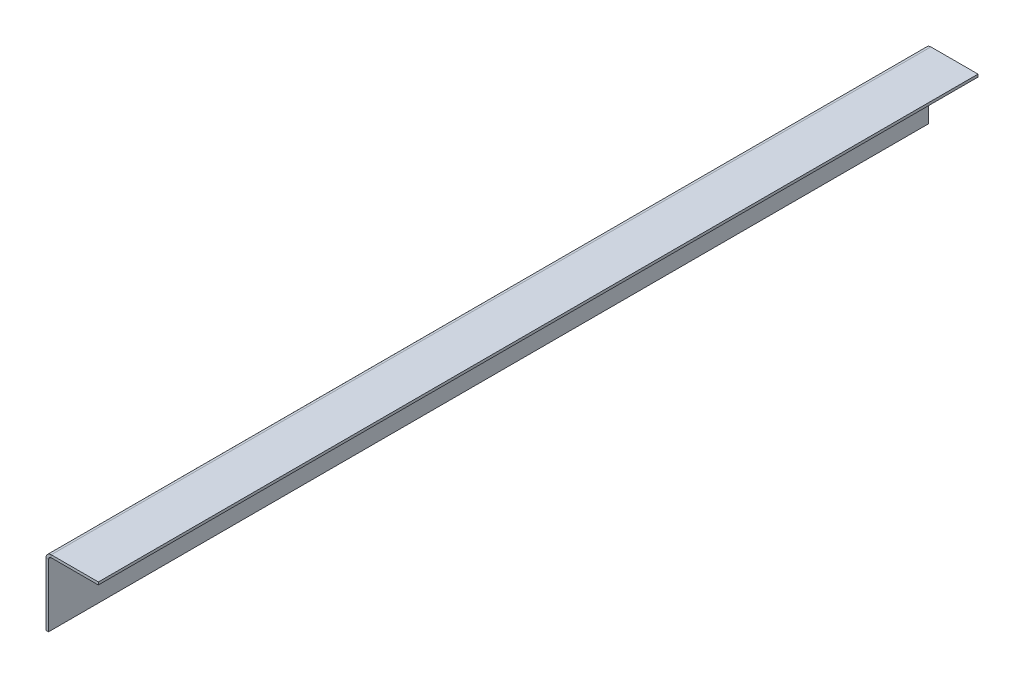
ISO-10303-21;
HEADER;
FILE_DESCRIPTION(('STEP AP214'),'2;1');
FILE_NAME('part.step','',(''),(''),'','','');
FILE_SCHEMA(('AUTOMOTIVE_DESIGN { 1 0 10303 214 1 1 1 1 }'));
ENDSEC;
DATA;
#1=APPLICATION_CONTEXT('core data for automotive mechanical design processes');
#2=APPLICATION_PROTOCOL_DEFINITION('international standard','automotive_design',2000,#1);
#3=PRODUCT_CONTEXT('',#1,'mechanical');
#4=PRODUCT('Part','Part','',(#3));
#5=PRODUCT_RELATED_PRODUCT_CATEGORY('part','',(#4));
#6=PRODUCT_DEFINITION_FORMATION('','',#4);
#7=PRODUCT_DEFINITION_CONTEXT('part definition',#1,'design');
#8=PRODUCT_DEFINITION('design','',#6,#7);
#9=PRODUCT_DEFINITION_SHAPE('','',#8);
#10=(LENGTH_UNIT() NAMED_UNIT(*) SI_UNIT(.MILLI.,.METRE.));
#11=(NAMED_UNIT(*) PLANE_ANGLE_UNIT() SI_UNIT($,.RADIAN.));
#12=(NAMED_UNIT(*) SI_UNIT($,.STERADIAN.) SOLID_ANGLE_UNIT());
#13=UNCERTAINTY_MEASURE_WITH_UNIT(LENGTH_MEASURE(1.E-05),#10,'distance_accuracy_value','');
#14=(GEOMETRIC_REPRESENTATION_CONTEXT(3) GLOBAL_UNCERTAINTY_ASSIGNED_CONTEXT((#13)) GLOBAL_UNIT_ASSIGNED_CONTEXT((#10,
#11,#12)) REPRESENTATION_CONTEXT('',''));
#15=CARTESIAN_POINT('',(0.,0.,0.));
#16=DIRECTION('',(0.,0.,1.));
#17=DIRECTION('',(1.,0.,0.));
#18=AXIS2_PLACEMENT_3D('',#15,#16,#17);
#19=CARTESIAN_POINT('',(-3.175,0.,0.));
#20=DIRECTION('',(0.,0.,1.));
#21=DIRECTION('',(1.,0.,0.));
#22=AXIS2_PLACEMENT_3D('',#19,#20,#21);
#23=PLANE('',#22);
#24=DIRECTION('',(0.,-1.,0.));
#25=VECTOR('',#24,1.);
#26=CARTESIAN_POINT('',(0.,0.,0.));
#27=LINE('',#26,#25);
#28=CARTESIAN_POINT('',(0.,76.2,0.));
#29=VERTEX_POINT('',#28);
#30=CARTESIAN_POINT('',(0.,0.,0.));
#31=VERTEX_POINT('',#30);
#32=EDGE_CURVE('E99',#29,#31,#27,.T.);
#33=ORIENTED_EDGE('',*,*,#32,.F.);
#34=DIRECTION('',(-1.,0.,0.));
#35=VECTOR('',#34,1.);
#36=CARTESIAN_POINT('',(0.,76.2,0.));
#37=LINE('',#36,#35);
#38=CARTESIAN_POINT('',(-3.17500000000001,76.2,0.));
#39=VERTEX_POINT('',#38);
#40=EDGE_CURVE('E117',#29,#39,#37,.T.);
#41=ORIENTED_EDGE('',*,*,#40,.T.);
#42=DIRECTION('',(0.,-1.,0.));
#43=VECTOR('',#42,1.);
#44=CARTESIAN_POINT('',(-3.175,0.,0.));
#45=LINE('',#44,#43);
#46=CARTESIAN_POINT('',(-3.175,0.,0.));
#47=VERTEX_POINT('',#46);
#48=EDGE_CURVE('E84',#39,#47,#45,.T.);
#49=ORIENTED_EDGE('',*,*,#48,.T.);
#50=DIRECTION('',(1.,0.,0.));
#51=VECTOR('',#50,1.);
#52=CARTESIAN_POINT('',(-3.175,0.,0.));
#53=LINE('',#52,#51);
#54=EDGE_CURVE('E13',#47,#31,#53,.T.);
#55=ORIENTED_EDGE('',*,*,#54,.T.);
#56=EDGE_LOOP('',(#33,#41,#49,#55));
#57=FACE_BOUND('',#56,.T.);
#58=ADVANCED_FACE('F61',(#57),#23,.T.);
#59=CARTESIAN_POINT('',(-3.175,0.,0.));
#60=DIRECTION('',(-1.,0.,0.));
#61=DIRECTION('',(0.,0.,1.));
#62=AXIS2_PLACEMENT_3D('',#59,#60,#61);
#63=PLANE('',#62);
#64=ORIENTED_EDGE('',*,*,#48,.F.);
#65=DIRECTION('',(0.,0.,1.));
#66=VECTOR('',#65,1.);
#67=CARTESIAN_POINT('',(-3.17500000000001,76.2,0.));
#68=LINE('',#67,#66);
#69=CARTESIAN_POINT('',(-3.175,76.2,-1066.8));
#70=VERTEX_POINT('',#69);
#71=EDGE_CURVE('E137',#39,#70,#68,.F.);
#72=ORIENTED_EDGE('',*,*,#71,.T.);
#73=DIRECTION('',(0.,1.,0.));
#74=VECTOR('',#73,1.);
#75=CARTESIAN_POINT('',(-3.175,0.,-1066.8));
#76=LINE('',#75,#74);
#77=CARTESIAN_POINT('',(-3.175,0.,-1066.8));
#78=VERTEX_POINT('',#77);
#79=EDGE_CURVE('E121',#78,#70,#76,.T.);
#80=ORIENTED_EDGE('',*,*,#79,.F.);
#81=DIRECTION('',(0.,0.,-1.));
#82=VECTOR('',#81,1.);
#83=CARTESIAN_POINT('',(-3.175,0.,-1066.8));
#84=LINE('',#83,#82);
#85=EDGE_CURVE('E107',#47,#78,#84,.T.);
#86=ORIENTED_EDGE('',*,*,#85,.F.);
#87=EDGE_LOOP('',(#64,#72,#80,#86));
#88=FACE_BOUND('',#87,.T.);
#89=ADVANCED_FACE('F230',(#88),#63,.T.);
#90=CARTESIAN_POINT('',(0.,0.,0.));
#91=DIRECTION('',(-1.,0.,0.));
#92=DIRECTION('',(0.,0.,1.));
#93=AXIS2_PLACEMENT_3D('',#90,#91,#92);
#94=PLANE('',#93);
#95=DIRECTION('',(0.,0.,1.));
#96=VECTOR('',#95,1.);
#97=CARTESIAN_POINT('',(0.,76.2,0.));
#98=LINE('',#97,#96);
#99=CARTESIAN_POINT('',(0.,76.2,-1066.8));
#100=VERTEX_POINT('',#99);
#101=EDGE_CURVE('E106',#29,#100,#98,.F.);
#102=ORIENTED_EDGE('',*,*,#101,.F.);
#103=ORIENTED_EDGE('',*,*,#32,.T.);
#104=DIRECTION('',(0.,0.,-1.));
#105=VECTOR('',#104,1.);
#106=CARTESIAN_POINT('',(0.,0.,-1066.8));
#107=LINE('',#106,#105);
#108=CARTESIAN_POINT('',(0.,0.,-1066.8));
#109=VERTEX_POINT('',#108);
#110=EDGE_CURVE('E103',#31,#109,#107,.T.);
#111=ORIENTED_EDGE('',*,*,#110,.T.);
#112=DIRECTION('',(0.,1.,0.));
#113=VECTOR('',#112,1.);
#114=CARTESIAN_POINT('',(0.,0.,-1066.8));
#115=LINE('',#114,#113);
#116=EDGE_CURVE('E108',#109,#100,#115,.T.);
#117=ORIENTED_EDGE('',*,*,#116,.T.);
#118=EDGE_LOOP('',(#102,#103,#111,#117));
#119=FACE_BOUND('',#118,.T.);
#120=ADVANCED_FACE('F100',(#119),#94,.F.);
#121=CARTESIAN_POINT('',(-3.175,0.,-1066.8));
#122=DIRECTION('',(0.,-1.,0.));
#123=DIRECTION('',(0.,0.,-1.));
#124=AXIS2_PLACEMENT_3D('',#121,#122,#123);
#125=PLANE('',#124);
#126=ORIENTED_EDGE('',*,*,#110,.F.);
#127=ORIENTED_EDGE('',*,*,#54,.F.);
#128=ORIENTED_EDGE('',*,*,#85,.T.);
#129=DIRECTION('',(1.,0.,0.));
#130=VECTOR('',#129,1.);
#131=CARTESIAN_POINT('',(-3.175,0.,-1066.8));
#132=LINE('',#131,#130);
#133=EDGE_CURVE('E65',#78,#109,#132,.T.);
#134=ORIENTED_EDGE('',*,*,#133,.T.);
#135=EDGE_LOOP('',(#126,#127,#128,#134));
#136=FACE_BOUND('',#135,.T.);
#137=ADVANCED_FACE('F63',(#136),#125,.T.);
#138=CARTESIAN_POINT('',(-3.175,0.,-1066.8));
#139=DIRECTION('',(0.,0.,-1.));
#140=DIRECTION('',(0.,1.,0.));
#141=AXIS2_PLACEMENT_3D('',#138,#139,#140);
#142=PLANE('',#141);
#143=DIRECTION('',(-1.,0.,0.));
#144=VECTOR('',#143,1.);
#145=CARTESIAN_POINT('',(0.,76.2,-1066.8));
#146=LINE('',#145,#144);
#147=EDGE_CURVE('E114',#100,#70,#146,.T.);
#148=ORIENTED_EDGE('',*,*,#147,.F.);
#149=ORIENTED_EDGE('',*,*,#116,.F.);
#150=ORIENTED_EDGE('',*,*,#133,.F.);
#151=ORIENTED_EDGE('',*,*,#79,.T.);
#152=EDGE_LOOP('',(#148,#149,#150,#151));
#153=FACE_BOUND('',#152,.T.);
#154=ADVANCED_FACE('F227',(#153),#142,.T.);
#155=CARTESIAN_POINT('',(3.17499999999999,76.2,-1066.8));
#156=DIRECTION('',(0.,0.,-1.));
#157=DIRECTION('',(-1.,0.,0.));
#158=AXIS2_PLACEMENT_3D('',#155,#156,#157);
#159=PLANE('',#158);
#160=DIRECTION('',(0.,-1.,0.));
#161=VECTOR('',#160,1.);
#162=CARTESIAN_POINT('',(3.17499999999997,82.55,-1066.8));
#163=LINE('',#162,#161);
#164=CARTESIAN_POINT('',(3.17499999999998,79.375,-1066.8));
#165=VERTEX_POINT('',#164);
#166=CARTESIAN_POINT('',(3.17499999999997,82.55,-1066.8));
#167=VERTEX_POINT('',#166);
#168=EDGE_CURVE('E141',#165,#167,#163,.F.);
#169=ORIENTED_EDGE('',*,*,#168,.F.);
#170=CARTESIAN_POINT('',(3.17499999999999,76.2,-1066.8));
#171=DIRECTION('',(0.,0.,1.));
#172=DIRECTION('',(1.,0.,0.));
#173=AXIS2_PLACEMENT_3D('',#170,#171,#172);
#174=CIRCLE('',#173,3.175);
#175=EDGE_CURVE('E131',#100,#165,#174,.F.);
#176=ORIENTED_EDGE('',*,*,#175,.F.);
#177=ORIENTED_EDGE('',*,*,#147,.T.);
#178=CARTESIAN_POINT('',(3.17499999999999,76.2,-1066.8));
#179=DIRECTION('',(0.,0.,1.));
#180=DIRECTION('',(1.,0.,0.));
#181=AXIS2_PLACEMENT_3D('',#178,#179,#180);
#182=CIRCLE('',#181,6.35);
#183=EDGE_CURVE('E76',#70,#167,#182,.F.);
#184=ORIENTED_EDGE('',*,*,#183,.T.);
#185=EDGE_LOOP('',(#169,#176,#177,#184));
#186=FACE_BOUND('',#185,.T.);
#187=ADVANCED_FACE('F224',(#186),#159,.T.);
#188=CARTESIAN_POINT('',(3.17499999999999,76.2,0.));
#189=DIRECTION('',(0.,0.,-1.));
#190=DIRECTION('',(-1.,0.,0.));
#191=AXIS2_PLACEMENT_3D('',#188,#189,#190);
#192=PLANE('',#191);
#193=CARTESIAN_POINT('',(3.17499999999999,76.2,0.));
#194=DIRECTION('',(0.,0.,1.));
#195=DIRECTION('',(1.,0.,0.));
#196=AXIS2_PLACEMENT_3D('',#193,#194,#195);
#197=CIRCLE('',#196,3.175);
#198=CARTESIAN_POINT('',(3.17499999999998,79.375,0.));
#199=VERTEX_POINT('',#198);
#200=EDGE_CURVE('E126',#199,#29,#197,.T.);
#201=ORIENTED_EDGE('',*,*,#200,.F.);
#202=DIRECTION('',(0.,-1.,0.));
#203=VECTOR('',#202,1.);
#204=CARTESIAN_POINT('',(3.17499999999997,79.375,0.));
#205=LINE('',#204,#203);
#206=CARTESIAN_POINT('',(3.17499999999996,82.55,0.));
#207=VERTEX_POINT('',#206);
#208=EDGE_CURVE('E147',#199,#207,#205,.F.);
#209=ORIENTED_EDGE('',*,*,#208,.T.);
#210=CARTESIAN_POINT('',(3.17499999999999,76.2,0.));
#211=DIRECTION('',(0.,0.,1.));
#212=DIRECTION('',(1.,0.,0.));
#213=AXIS2_PLACEMENT_3D('',#210,#211,#212);
#214=CIRCLE('',#213,6.35);
#215=EDGE_CURVE('E134',#207,#39,#214,.T.);
#216=ORIENTED_EDGE('',*,*,#215,.T.);
#217=ORIENTED_EDGE('',*,*,#40,.F.);
#218=EDGE_LOOP('',(#201,#209,#216,#217));
#219=FACE_BOUND('',#218,.T.);
#220=ADVANCED_FACE('F221',(#219),#192,.F.);
#221=CARTESIAN_POINT('',(3.17499999999999,76.2,0.));
#222=DIRECTION('',(0.,0.,1.));
#223=DIRECTION('',(0.,1.,0.));
#224=AXIS2_PLACEMENT_3D('',#221,#222,#223);
#225=CYLINDRICAL_SURFACE('',#224,6.35);
#226=ORIENTED_EDGE('',*,*,#71,.F.);
#227=ORIENTED_EDGE('',*,*,#215,.F.);
#228=DIRECTION('',(0.,0.,1.));
#229=VECTOR('',#228,1.);
#230=CARTESIAN_POINT('',(3.17499999999997,82.55,-1066.8));
#231=LINE('',#230,#229);
#232=EDGE_CURVE('E150',#207,#167,#231,.F.);
#233=ORIENTED_EDGE('',*,*,#232,.T.);
#234=ORIENTED_EDGE('',*,*,#183,.F.);
#235=EDGE_LOOP('',(#226,#227,#233,#234));
#236=FACE_BOUND('',#235,.T.);
#237=ADVANCED_FACE('F231',(#236),#225,.T.);
#238=CARTESIAN_POINT('',(3.17499999999999,76.2,0.));
#239=DIRECTION('',(0.,0.,1.));
#240=DIRECTION('',(0.,1.,0.));
#241=AXIS2_PLACEMENT_3D('',#238,#239,#240);
#242=CYLINDRICAL_SURFACE('',#241,3.175);
#243=ORIENTED_EDGE('',*,*,#101,.T.);
#244=ORIENTED_EDGE('',*,*,#175,.T.);
#245=DIRECTION('',(0.,0.,1.));
#246=VECTOR('',#245,1.);
#247=CARTESIAN_POINT('',(3.17499999999998,79.375,-1066.8));
#248=LINE('',#247,#246);
#249=EDGE_CURVE('E144',#165,#199,#248,.T.);
#250=ORIENTED_EDGE('',*,*,#249,.T.);
#251=ORIENTED_EDGE('',*,*,#200,.T.);
#252=EDGE_LOOP('',(#243,#244,#250,#251));
#253=FACE_BOUND('',#252,.T.);
#254=ADVANCED_FACE('F223',(#253),#242,.F.);
#255=CARTESIAN_POINT('',(0.,82.55,-1066.8));
#256=DIRECTION('',(0.,0.,1.));
#257=DIRECTION('',(1.,0.,0.));
#258=AXIS2_PLACEMENT_3D('',#255,#256,#257);
#259=PLANE('',#258);
#260=ORIENTED_EDGE('',*,*,#168,.T.);
#261=DIRECTION('',(-1.,0.,0.));
#262=VECTOR('',#261,1.);
#263=CARTESIAN_POINT('',(-2.95945308253334E-13,82.55,-1066.8));
#264=LINE('',#263,#262);
#265=CARTESIAN_POINT('',(60.325,82.5500000000002,-1066.8));
#266=VERTEX_POINT('',#265);
#267=EDGE_CURVE('E161',#266,#167,#264,.T.);
#268=ORIENTED_EDGE('',*,*,#267,.F.);
#269=DIRECTION('',(0.,-1.,0.));
#270=VECTOR('',#269,1.);
#271=CARTESIAN_POINT('',(60.325,82.5500000000002,-1066.8));
#272=LINE('',#271,#270);
#273=CARTESIAN_POINT('',(60.325,79.3750000000002,-1066.8));
#274=VERTEX_POINT('',#273);
#275=EDGE_CURVE('E170',#266,#274,#272,.T.);
#276=ORIENTED_EDGE('',*,*,#275,.T.);
#277=DIRECTION('',(1.,0.,0.));
#278=VECTOR('',#277,1.);
#279=CARTESIAN_POINT('',(0.,79.375,-1066.8));
#280=LINE('',#279,#278);
#281=EDGE_CURVE('E152',#274,#165,#280,.F.);
#282=ORIENTED_EDGE('',*,*,#281,.T.);
#283=EDGE_LOOP('',(#260,#268,#276,#282));
#284=FACE_BOUND('',#283,.T.);
#285=ADVANCED_FACE('F196',(#284),#259,.F.);
#286=CARTESIAN_POINT('',(60.325,82.5500000000002,0.));
#287=DIRECTION('',(0.,0.,-1.));
#288=DIRECTION('',(-1.,0.,0.));
#289=AXIS2_PLACEMENT_3D('',#286,#287,#288);
#290=PLANE('',#289);
#291=ORIENTED_EDGE('',*,*,#208,.F.);
#292=DIRECTION('',(-1.,0.,0.));
#293=VECTOR('',#292,1.);
#294=CARTESIAN_POINT('',(60.325,79.3750000000002,0.));
#295=LINE('',#294,#293);
#296=CARTESIAN_POINT('',(60.325,79.3750000000002,0.));
#297=VERTEX_POINT('',#296);
#298=EDGE_CURVE('E155',#199,#297,#295,.F.);
#299=ORIENTED_EDGE('',*,*,#298,.T.);
#300=DIRECTION('',(0.,-1.,0.));
#301=VECTOR('',#300,1.);
#302=CARTESIAN_POINT('',(60.325,82.5500000000002,0.));
#303=LINE('',#302,#301);
#304=CARTESIAN_POINT('',(60.325,82.5500000000002,0.));
#305=VERTEX_POINT('',#304);
#306=EDGE_CURVE('E129',#305,#297,#303,.T.);
#307=ORIENTED_EDGE('',*,*,#306,.F.);
#308=DIRECTION('',(1.,0.,0.));
#309=VECTOR('',#308,1.);
#310=CARTESIAN_POINT('',(-2.95945308253334E-13,82.55,0.));
#311=LINE('',#310,#309);
#312=EDGE_CURVE('E164',#207,#305,#311,.T.);
#313=ORIENTED_EDGE('',*,*,#312,.F.);
#314=EDGE_LOOP('',(#291,#299,#307,#313));
#315=FACE_BOUND('',#314,.T.);
#316=ADVANCED_FACE('F218',(#315),#290,.F.);
#317=CARTESIAN_POINT('',(-2.95945308253334E-13,82.55,0.));
#318=DIRECTION('',(0.,-1.,0.));
#319=DIRECTION('',(1.,0.,0.));
#320=AXIS2_PLACEMENT_3D('',#317,#318,#319);
#321=PLANE('',#320);
#322=ORIENTED_EDGE('',*,*,#232,.F.);
#323=ORIENTED_EDGE('',*,*,#312,.T.);
#324=DIRECTION('',(0.,0.,-1.));
#325=VECTOR('',#324,1.);
#326=CARTESIAN_POINT('',(60.325,82.5500000000002,0.));
#327=LINE('',#326,#325);
#328=EDGE_CURVE('E167',#305,#266,#327,.T.);
#329=ORIENTED_EDGE('',*,*,#328,.T.);
#330=ORIENTED_EDGE('',*,*,#267,.T.);
#331=EDGE_LOOP('',(#322,#323,#329,#330));
#332=FACE_BOUND('',#331,.T.);
#333=ADVANCED_FACE('F216',(#332),#321,.F.);
#334=CARTESIAN_POINT('',(-2.84859855002507E-13,79.375,0.));
#335=DIRECTION('',(0.,-1.,0.));
#336=DIRECTION('',(1.,0.,0.));
#337=AXIS2_PLACEMENT_3D('',#334,#335,#336);
#338=PLANE('',#337);
#339=ORIENTED_EDGE('',*,*,#298,.F.);
#340=ORIENTED_EDGE('',*,*,#249,.F.);
#341=ORIENTED_EDGE('',*,*,#281,.F.);
#342=DIRECTION('',(0.,0.,1.));
#343=VECTOR('',#342,1.);
#344=CARTESIAN_POINT('',(60.325,79.3750000000002,-1066.8));
#345=LINE('',#344,#343);
#346=EDGE_CURVE('E158',#297,#274,#345,.F.);
#347=ORIENTED_EDGE('',*,*,#346,.F.);
#348=EDGE_LOOP('',(#339,#340,#341,#347));
#349=FACE_BOUND('',#348,.T.);
#350=ADVANCED_FACE('F190',(#349),#338,.T.);
#351=CARTESIAN_POINT('',(60.325,82.5500000000002,-1066.8));
#352=DIRECTION('',(-1.,0.,0.));
#353=DIRECTION('',(0.,-1.,0.));
#354=AXIS2_PLACEMENT_3D('',#351,#352,#353);
#355=PLANE('',#354);
#356=ORIENTED_EDGE('',*,*,#346,.T.);
#357=ORIENTED_EDGE('',*,*,#275,.F.);
#358=ORIENTED_EDGE('',*,*,#328,.F.);
#359=ORIENTED_EDGE('',*,*,#306,.T.);
#360=EDGE_LOOP('',(#356,#357,#358,#359));
#361=FACE_BOUND('',#360,.T.);
#362=ADVANCED_FACE('F179',(#361),#355,.F.);
#363=CLOSED_SHELL('',(#58,#89,#120,#137,#154,#187,#220,#237,#254,#285,#316,#333,#350,#362));
#364=MANIFOLD_SOLID_BREP('B2',#363);
#365=ADVANCED_BREP_SHAPE_REPRESENTATION('',(#18,#364),#14);
#366=SHAPE_DEFINITION_REPRESENTATION(#9,#365);
ENDSEC;
END-ISO-10303-21;
